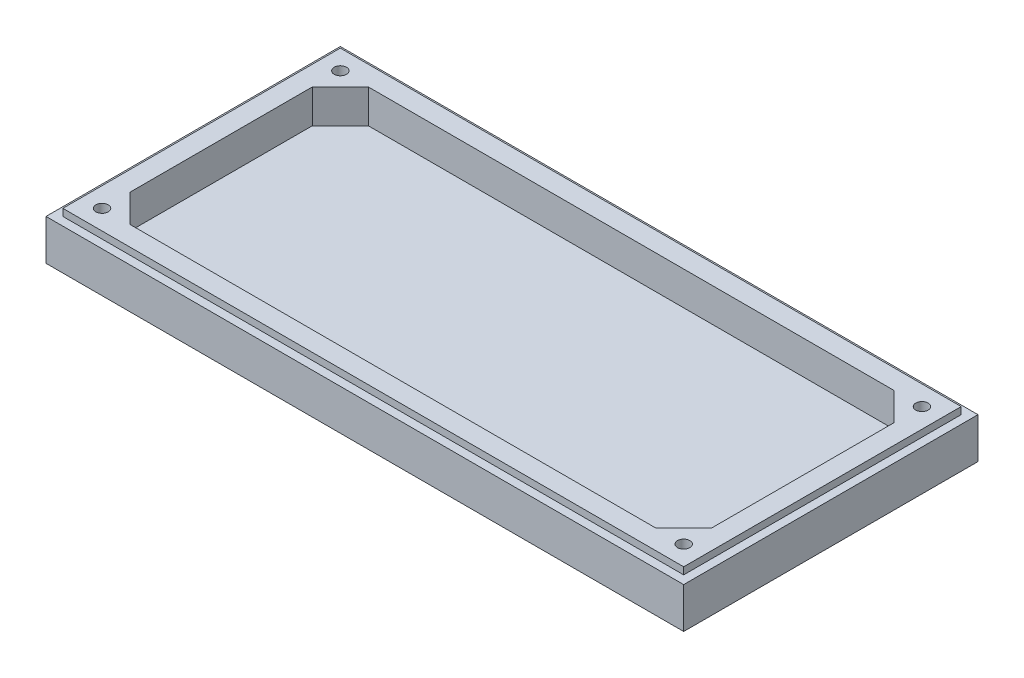
ISO-10303-21;
HEADER;
FILE_DESCRIPTION(('STEP AP214'),'2;1');
FILE_NAME('part.step','',(''),(''),'','','');
FILE_SCHEMA(('AUTOMOTIVE_DESIGN { 1 0 10303 214 1 1 1 1 }'));
ENDSEC;
DATA;
#1=APPLICATION_CONTEXT('core data for automotive mechanical design processes');
#2=APPLICATION_PROTOCOL_DEFINITION('international standard','automotive_design',2000,#1);
#3=PRODUCT_CONTEXT('',#1,'mechanical');
#4=PRODUCT('Part','Part','',(#3));
#5=PRODUCT_RELATED_PRODUCT_CATEGORY('part','',(#4));
#6=PRODUCT_DEFINITION_FORMATION('','',#4);
#7=PRODUCT_DEFINITION_CONTEXT('part definition',#1,'design');
#8=PRODUCT_DEFINITION('design','',#6,#7);
#9=PRODUCT_DEFINITION_SHAPE('','',#8);
#10=(LENGTH_UNIT() NAMED_UNIT(*) SI_UNIT(.MILLI.,.METRE.));
#11=(NAMED_UNIT(*) PLANE_ANGLE_UNIT() SI_UNIT($,.RADIAN.));
#12=(NAMED_UNIT(*) SI_UNIT($,.STERADIAN.) SOLID_ANGLE_UNIT());
#13=UNCERTAINTY_MEASURE_WITH_UNIT(LENGTH_MEASURE(1.E-05),#10,'distance_accuracy_value','');
#14=(GEOMETRIC_REPRESENTATION_CONTEXT(3) GLOBAL_UNCERTAINTY_ASSIGNED_CONTEXT((#13)) GLOBAL_UNIT_ASSIGNED_CONTEXT((#10,
#11,#12)) REPRESENTATION_CONTEXT('',''));
#15=CARTESIAN_POINT('',(0.,0.,0.));
#16=DIRECTION('',(0.,0.,1.));
#17=DIRECTION('',(1.,0.,0.));
#18=AXIS2_PLACEMENT_3D('',#15,#16,#17);
#19=CARTESIAN_POINT('',(0.,0.,0.));
#20=DIRECTION('',(0.,-1.,0.));
#21=DIRECTION('',(0.,0.,-1.));
#22=AXIS2_PLACEMENT_3D('',#19,#20,#21);
#23=PLANE('',#22);
#24=CARTESIAN_POINT('',(20.,0.,-20.));
#25=DIRECTION('',(0.,1.,0.));
#26=DIRECTION('',(0.,0.,-1.));
#27=AXIS2_PLACEMENT_3D('',#24,#25,#26);
#28=CIRCLE('',#27,4.4);
#29=CARTESIAN_POINT('',(20.,0.,-24.4));
#30=VERTEX_POINT('',#29);
#31=EDGE_CURVE('E757',#30,#30,#28,.T.);
#32=ORIENTED_EDGE('',*,*,#31,.F.);
#33=EDGE_LOOP('',(#32));
#34=FACE_BOUND('',#33,.T.);
#35=CARTESIAN_POINT('',(435.,0.,-19.9999999999999));
#36=DIRECTION('',(0.,1.,0.));
#37=DIRECTION('',(0.,0.,1.));
#38=AXIS2_PLACEMENT_3D('',#35,#36,#37);
#39=CIRCLE('',#38,4.40000000000002);
#40=CARTESIAN_POINT('',(435.,0.,-15.5999999999999));
#41=VERTEX_POINT('',#40);
#42=EDGE_CURVE('E773',#41,#41,#39,.T.);
#43=ORIENTED_EDGE('',*,*,#42,.F.);
#44=EDGE_LOOP('',(#43));
#45=FACE_BOUND('',#44,.T.);
#46=CARTESIAN_POINT('',(435.,0.,-190.));
#47=DIRECTION('',(0.,1.,0.));
#48=DIRECTION('',(0.,0.,-1.));
#49=AXIS2_PLACEMENT_3D('',#46,#47,#48);
#50=CIRCLE('',#49,4.40000000000003);
#51=CARTESIAN_POINT('',(435.,0.,-194.4));
#52=VERTEX_POINT('',#51);
#53=EDGE_CURVE('E765',#52,#52,#50,.T.);
#54=ORIENTED_EDGE('',*,*,#53,.F.);
#55=EDGE_LOOP('',(#54));
#56=FACE_BOUND('',#55,.T.);
#57=CARTESIAN_POINT('',(20.,0.,-190.));
#58=DIRECTION('',(0.,1.,0.));
#59=DIRECTION('',(0.,0.,1.));
#60=AXIS2_PLACEMENT_3D('',#57,#58,#59);
#61=CIRCLE('',#60,4.4);
#62=CARTESIAN_POINT('',(20.,0.,-185.6));
#63=VERTEX_POINT('',#62);
#64=EDGE_CURVE('E184',#63,#63,#61,.T.);
#65=ORIENTED_EDGE('',*,*,#64,.F.);
#66=EDGE_LOOP('',(#65));
#67=FACE_BOUND('',#66,.T.);
#68=DIRECTION('',(0.707106781186548,0.,0.707106781186548));
#69=VECTOR('',#68,1.);
#70=CARTESIAN_POINT('',(20.,0.,-40.));
#71=LINE('',#70,#69);
#72=CARTESIAN_POINT('',(20.,0.,-40.));
#73=VERTEX_POINT('',#72);
#74=CARTESIAN_POINT('',(40.,0.,-20.));
#75=VERTEX_POINT('',#74);
#76=EDGE_CURVE('E232',#73,#75,#71,.T.);
#77=ORIENTED_EDGE('',*,*,#76,.F.);
#78=DIRECTION('',(0.,0.,1.));
#79=VECTOR('',#78,1.);
#80=CARTESIAN_POINT('',(20.,0.,-170.));
#81=LINE('',#80,#79);
#82=CARTESIAN_POINT('',(20.,0.,-170.));
#83=VERTEX_POINT('',#82);
#84=EDGE_CURVE('E204',#83,#73,#81,.T.);
#85=ORIENTED_EDGE('',*,*,#84,.F.);
#86=DIRECTION('',(-0.707106781186547,0.,0.707106781186547));
#87=VECTOR('',#86,1.);
#88=CARTESIAN_POINT('',(40.,0.,-190.));
#89=LINE('',#88,#87);
#90=CARTESIAN_POINT('',(40.,0.,-190.));
#91=VERTEX_POINT('',#90);
#92=EDGE_CURVE('E209',#91,#83,#89,.T.);
#93=ORIENTED_EDGE('',*,*,#92,.F.);
#94=DIRECTION('',(-1.,0.,0.));
#95=VECTOR('',#94,1.);
#96=CARTESIAN_POINT('',(40.,0.,-190.));
#97=LINE('',#96,#95);
#98=CARTESIAN_POINT('',(415.,0.,-190.));
#99=VERTEX_POINT('',#98);
#100=EDGE_CURVE('E247',#99,#91,#97,.T.);
#101=ORIENTED_EDGE('',*,*,#100,.F.);
#102=DIRECTION('',(-0.707106781186548,0.,-0.707106781186547));
#103=VECTOR('',#102,1.);
#104=CARTESIAN_POINT('',(415.,0.,-190.));
#105=LINE('',#104,#103);
#106=CARTESIAN_POINT('',(435.,0.,-170.));
#107=VERTEX_POINT('',#106);
#108=EDGE_CURVE('E244',#107,#99,#105,.T.);
#109=ORIENTED_EDGE('',*,*,#108,.F.);
#110=DIRECTION('',(0.,0.,-1.));
#111=VECTOR('',#110,1.);
#112=CARTESIAN_POINT('',(435.,0.,-170.));
#113=LINE('',#112,#111);
#114=CARTESIAN_POINT('',(435.,0.,-40.));
#115=VERTEX_POINT('',#114);
#116=EDGE_CURVE('E241',#115,#107,#113,.T.);
#117=ORIENTED_EDGE('',*,*,#116,.F.);
#118=DIRECTION('',(0.707106781186548,0.,-0.707106781186547));
#119=VECTOR('',#118,1.);
#120=CARTESIAN_POINT('',(415.,0.,-20.));
#121=LINE('',#120,#119);
#122=CARTESIAN_POINT('',(415.,0.,-20.));
#123=VERTEX_POINT('',#122);
#124=EDGE_CURVE('E238',#123,#115,#121,.T.);
#125=ORIENTED_EDGE('',*,*,#124,.F.);
#126=DIRECTION('',(1.,0.,0.));
#127=VECTOR('',#126,1.);
#128=CARTESIAN_POINT('',(40.,0.,-20.));
#129=LINE('',#128,#127);
#130=EDGE_CURVE('E235',#75,#123,#129,.T.);
#131=ORIENTED_EDGE('',*,*,#130,.F.);
#132=EDGE_LOOP('',(#77,#85,#93,#101,#109,#117,#125,#131));
#133=FACE_BOUND('',#132,.T.);
#134=DIRECTION('',(0.,0.,1.));
#135=VECTOR('',#134,1.);
#136=CARTESIAN_POINT('',(6.,0.,-204.));
#137=LINE('',#136,#135);
#138=CARTESIAN_POINT('',(6.,0.,-204.));
#139=VERTEX_POINT('',#138);
#140=CARTESIAN_POINT('',(6.00000000000003,0.,-6.00000000000001));
#141=VERTEX_POINT('',#140);
#142=EDGE_CURVE('E189',#139,#141,#137,.T.);
#143=ORIENTED_EDGE('',*,*,#142,.T.);
#144=DIRECTION('',(1.,0.,0.));
#145=VECTOR('',#144,1.);
#146=CARTESIAN_POINT('',(6.00000000000002,0.,-6.));
#147=LINE('',#146,#145);
#148=CARTESIAN_POINT('',(449.,0.,-6.));
#149=VERTEX_POINT('',#148);
#150=EDGE_CURVE('E160',#141,#149,#147,.T.);
#151=ORIENTED_EDGE('',*,*,#150,.T.);
#152=DIRECTION('',(0.,0.,-1.));
#153=VECTOR('',#152,1.);
#154=CARTESIAN_POINT('',(449.,0.,-204.));
#155=LINE('',#154,#153);
#156=CARTESIAN_POINT('',(449.,0.,-204.));
#157=VERTEX_POINT('',#156);
#158=EDGE_CURVE('E64',#149,#157,#155,.T.);
#159=ORIENTED_EDGE('',*,*,#158,.T.);
#160=DIRECTION('',(-1.,0.,0.));
#161=VECTOR('',#160,1.);
#162=CARTESIAN_POINT('',(6.,0.,-204.));
#163=LINE('',#162,#161);
#164=EDGE_CURVE('E179',#157,#139,#163,.T.);
#165=ORIENTED_EDGE('',*,*,#164,.T.);
#166=EDGE_LOOP('',(#143,#151,#159,#165));
#167=FACE_BOUND('',#166,.T.);
#168=ADVANCED_FACE('F42',(#34,#45,#56,#67,#133,#167),#23,.F.);
#169=CARTESIAN_POINT('',(20.,-24.,-170.));
#170=DIRECTION('',(-1.,0.,0.));
#171=DIRECTION('',(0.,0.,1.));
#172=AXIS2_PLACEMENT_3D('',#169,#170,#171);
#173=PLANE('',#172);
#174=ORIENTED_EDGE('',*,*,#84,.T.);
#175=DIRECTION('',(0.,1.,0.));
#176=VECTOR('',#175,1.);
#177=CARTESIAN_POINT('',(20.,-24.,-40.));
#178=LINE('',#177,#176);
#179=CARTESIAN_POINT('',(20.,-24.,-40.));
#180=VERTEX_POINT('',#179);
#181=EDGE_CURVE('E230',#180,#73,#178,.T.);
#182=ORIENTED_EDGE('',*,*,#181,.F.);
#183=DIRECTION('',(0.,0.,1.));
#184=VECTOR('',#183,1.);
#185=CARTESIAN_POINT('',(20.,-24.,-170.));
#186=LINE('',#185,#184);
#187=CARTESIAN_POINT('',(20.,-24.,-170.));
#188=VERTEX_POINT('',#187);
#189=EDGE_CURVE('E205',#188,#180,#186,.T.);
#190=ORIENTED_EDGE('',*,*,#189,.F.);
#191=DIRECTION('',(0.,1.,0.));
#192=VECTOR('',#191,1.);
#193=CARTESIAN_POINT('',(20.,-24.,-170.));
#194=LINE('',#193,#192);
#195=EDGE_CURVE('E252',#188,#83,#194,.T.);
#196=ORIENTED_EDGE('',*,*,#195,.T.);
#197=EDGE_LOOP('',(#174,#182,#190,#196));
#198=FACE_BOUND('',#197,.T.);
#199=ADVANCED_FACE('F315',(#198),#173,.F.);
#200=CARTESIAN_POINT('',(40.,-24.,-190.));
#201=DIRECTION('',(-0.707106781186548,0.,-0.707106781186548));
#202=DIRECTION('',(-0.707106781186548,0.,0.707106781186548));
#203=AXIS2_PLACEMENT_3D('',#200,#201,#202);
#204=PLANE('',#203);
#205=ORIENTED_EDGE('',*,*,#92,.T.);
#206=ORIENTED_EDGE('',*,*,#195,.F.);
#207=DIRECTION('',(-0.707106781186547,0.,0.707106781186547));
#208=VECTOR('',#207,1.);
#209=CARTESIAN_POINT('',(40.,-24.,-190.));
#210=LINE('',#209,#208);
#211=CARTESIAN_POINT('',(40.,-24.,-190.));
#212=VERTEX_POINT('',#211);
#213=EDGE_CURVE('E227',#212,#188,#210,.T.);
#214=ORIENTED_EDGE('',*,*,#213,.F.);
#215=DIRECTION('',(0.,1.,0.));
#216=VECTOR('',#215,1.);
#217=CARTESIAN_POINT('',(40.,-24.,-190.));
#218=LINE('',#217,#216);
#219=EDGE_CURVE('E255',#212,#91,#218,.T.);
#220=ORIENTED_EDGE('',*,*,#219,.T.);
#221=EDGE_LOOP('',(#205,#206,#214,#220));
#222=FACE_BOUND('',#221,.T.);
#223=ADVANCED_FACE('F320',(#222),#204,.F.);
#224=CARTESIAN_POINT('',(40.,-24.,-190.));
#225=DIRECTION('',(0.,0.,-1.));
#226=DIRECTION('',(-1.,0.,0.));
#227=AXIS2_PLACEMENT_3D('',#224,#225,#226);
#228=PLANE('',#227);
#229=ORIENTED_EDGE('',*,*,#100,.T.);
#230=ORIENTED_EDGE('',*,*,#219,.F.);
#231=DIRECTION('',(-1.,0.,0.));
#232=VECTOR('',#231,1.);
#233=CARTESIAN_POINT('',(40.,-24.,-190.));
#234=LINE('',#233,#232);
#235=CARTESIAN_POINT('',(415.,-24.,-190.));
#236=VERTEX_POINT('',#235);
#237=EDGE_CURVE('E224',#236,#212,#234,.T.);
#238=ORIENTED_EDGE('',*,*,#237,.F.);
#239=DIRECTION('',(0.,1.,0.));
#240=VECTOR('',#239,1.);
#241=CARTESIAN_POINT('',(415.,-24.,-190.));
#242=LINE('',#241,#240);
#243=EDGE_CURVE('E257',#236,#99,#242,.T.);
#244=ORIENTED_EDGE('',*,*,#243,.T.);
#245=EDGE_LOOP('',(#229,#230,#238,#244));
#246=FACE_BOUND('',#245,.T.);
#247=ADVANCED_FACE('F364',(#246),#228,.F.);
#248=CARTESIAN_POINT('',(415.,-24.,-190.));
#249=DIRECTION('',(0.707106781186547,0.,-0.707106781186548));
#250=DIRECTION('',(-0.707106781186548,0.,-0.707106781186547));
#251=AXIS2_PLACEMENT_3D('',#248,#249,#250);
#252=PLANE('',#251);
#253=ORIENTED_EDGE('',*,*,#108,.T.);
#254=ORIENTED_EDGE('',*,*,#243,.F.);
#255=DIRECTION('',(-0.707106781186548,0.,-0.707106781186547));
#256=VECTOR('',#255,1.);
#257=CARTESIAN_POINT('',(415.,-24.,-190.));
#258=LINE('',#257,#256);
#259=CARTESIAN_POINT('',(435.,-24.,-170.));
#260=VERTEX_POINT('',#259);
#261=EDGE_CURVE('E221',#260,#236,#258,.T.);
#262=ORIENTED_EDGE('',*,*,#261,.F.);
#263=DIRECTION('',(0.,1.,0.));
#264=VECTOR('',#263,1.);
#265=CARTESIAN_POINT('',(435.,-24.,-170.));
#266=LINE('',#265,#264);
#267=EDGE_CURVE('E259',#260,#107,#266,.T.);
#268=ORIENTED_EDGE('',*,*,#267,.T.);
#269=EDGE_LOOP('',(#253,#254,#262,#268));
#270=FACE_BOUND('',#269,.T.);
#271=ADVANCED_FACE('F368',(#270),#252,.F.);
#272=CARTESIAN_POINT('',(435.,-24.,-170.));
#273=DIRECTION('',(1.,0.,0.));
#274=DIRECTION('',(0.,0.,-1.));
#275=AXIS2_PLACEMENT_3D('',#272,#273,#274);
#276=PLANE('',#275);
#277=ORIENTED_EDGE('',*,*,#116,.T.);
#278=ORIENTED_EDGE('',*,*,#267,.F.);
#279=DIRECTION('',(0.,0.,-1.));
#280=VECTOR('',#279,1.);
#281=CARTESIAN_POINT('',(435.,-24.,-170.));
#282=LINE('',#281,#280);
#283=CARTESIAN_POINT('',(435.,-24.,-40.));
#284=VERTEX_POINT('',#283);
#285=EDGE_CURVE('E218',#284,#260,#282,.T.);
#286=ORIENTED_EDGE('',*,*,#285,.F.);
#287=DIRECTION('',(0.,1.,0.));
#288=VECTOR('',#287,1.);
#289=CARTESIAN_POINT('',(435.,-24.,-40.));
#290=LINE('',#289,#288);
#291=EDGE_CURVE('E261',#284,#115,#290,.T.);
#292=ORIENTED_EDGE('',*,*,#291,.T.);
#293=EDGE_LOOP('',(#277,#278,#286,#292));
#294=FACE_BOUND('',#293,.T.);
#295=ADVANCED_FACE('F372',(#294),#276,.F.);
#296=CARTESIAN_POINT('',(415.,-24.,-20.));
#297=DIRECTION('',(0.707106781186547,0.,0.707106781186548));
#298=DIRECTION('',(0.707106781186548,0.,-0.707106781186547));
#299=AXIS2_PLACEMENT_3D('',#296,#297,#298);
#300=PLANE('',#299);
#301=ORIENTED_EDGE('',*,*,#124,.T.);
#302=ORIENTED_EDGE('',*,*,#291,.F.);
#303=DIRECTION('',(0.707106781186548,0.,-0.707106781186547));
#304=VECTOR('',#303,1.);
#305=CARTESIAN_POINT('',(415.,-24.,-20.));
#306=LINE('',#305,#304);
#307=CARTESIAN_POINT('',(415.,-24.,-20.));
#308=VERTEX_POINT('',#307);
#309=EDGE_CURVE('E215',#308,#284,#306,.T.);
#310=ORIENTED_EDGE('',*,*,#309,.F.);
#311=DIRECTION('',(0.,1.,0.));
#312=VECTOR('',#311,1.);
#313=CARTESIAN_POINT('',(415.,-24.,-20.));
#314=LINE('',#313,#312);
#315=EDGE_CURVE('E263',#308,#123,#314,.T.);
#316=ORIENTED_EDGE('',*,*,#315,.T.);
#317=EDGE_LOOP('',(#301,#302,#310,#316));
#318=FACE_BOUND('',#317,.T.);
#319=ADVANCED_FACE('F376',(#318),#300,.F.);
#320=CARTESIAN_POINT('',(40.,-24.,-20.));
#321=DIRECTION('',(0.,0.,1.));
#322=DIRECTION('',(1.,0.,0.));
#323=AXIS2_PLACEMENT_3D('',#320,#321,#322);
#324=PLANE('',#323);
#325=ORIENTED_EDGE('',*,*,#130,.T.);
#326=ORIENTED_EDGE('',*,*,#315,.F.);
#327=DIRECTION('',(1.,0.,0.));
#328=VECTOR('',#327,1.);
#329=CARTESIAN_POINT('',(40.,-24.,-20.));
#330=LINE('',#329,#328);
#331=CARTESIAN_POINT('',(40.,-24.,-20.));
#332=VERTEX_POINT('',#331);
#333=EDGE_CURVE('E212',#332,#308,#330,.T.);
#334=ORIENTED_EDGE('',*,*,#333,.F.);
#335=DIRECTION('',(0.,1.,0.));
#336=VECTOR('',#335,1.);
#337=CARTESIAN_POINT('',(40.,-24.,-20.));
#338=LINE('',#337,#336);
#339=EDGE_CURVE('E265',#332,#75,#338,.T.);
#340=ORIENTED_EDGE('',*,*,#339,.T.);
#341=EDGE_LOOP('',(#325,#326,#334,#340));
#342=FACE_BOUND('',#341,.T.);
#343=ADVANCED_FACE('F380',(#342),#324,.F.);
#344=CARTESIAN_POINT('',(20.,-24.,-40.));
#345=DIRECTION('',(-0.707106781186547,0.,0.707106781186547));
#346=DIRECTION('',(0.707106781186548,0.,0.707106781186548));
#347=AXIS2_PLACEMENT_3D('',#344,#345,#346);
#348=PLANE('',#347);
#349=ORIENTED_EDGE('',*,*,#76,.T.);
#350=ORIENTED_EDGE('',*,*,#339,.F.);
#351=DIRECTION('',(0.707106781186548,0.,0.707106781186548));
#352=VECTOR('',#351,1.);
#353=CARTESIAN_POINT('',(20.,-24.,-40.));
#354=LINE('',#353,#352);
#355=EDGE_CURVE('E208',#180,#332,#354,.T.);
#356=ORIENTED_EDGE('',*,*,#355,.F.);
#357=ORIENTED_EDGE('',*,*,#181,.T.);
#358=EDGE_LOOP('',(#349,#350,#356,#357));
#359=FACE_BOUND('',#358,.T.);
#360=ADVANCED_FACE('F360',(#359),#348,.F.);
#361=CARTESIAN_POINT('',(0.,-24.,0.));
#362=DIRECTION('',(0.,1.,0.));
#363=DIRECTION('',(0.,0.,1.));
#364=AXIS2_PLACEMENT_3D('',#361,#362,#363);
#365=PLANE('',#364);
#366=ORIENTED_EDGE('',*,*,#189,.T.);
#367=ORIENTED_EDGE('',*,*,#355,.T.);
#368=ORIENTED_EDGE('',*,*,#333,.T.);
#369=ORIENTED_EDGE('',*,*,#309,.T.);
#370=ORIENTED_EDGE('',*,*,#285,.T.);
#371=ORIENTED_EDGE('',*,*,#261,.T.);
#372=ORIENTED_EDGE('',*,*,#237,.T.);
#373=ORIENTED_EDGE('',*,*,#213,.T.);
#374=EDGE_LOOP('',(#366,#367,#368,#369,#370,#371,#372,#373));
#375=FACE_BOUND('',#374,.T.);
#376=ADVANCED_FACE('F357',(#375),#365,.T.);
#377=CARTESIAN_POINT('',(227.5,-5.,-105.));
#378=DIRECTION('',(0.,1.,0.));
#379=DIRECTION('',(0.,0.,1.));
#380=AXIS2_PLACEMENT_3D('',#377,#378,#379);
#381=PLANE('',#380);
#382=DIRECTION('',(-1.,0.,0.));
#383=VECTOR('',#382,1.);
#384=CARTESIAN_POINT('',(6.,-5.,-204.));
#385=LINE('',#384,#383);
#386=CARTESIAN_POINT('',(449.,-5.,-204.));
#387=VERTEX_POINT('',#386);
#388=CARTESIAN_POINT('',(6.,-5.,-204.));
#389=VERTEX_POINT('',#388);
#390=EDGE_CURVE('E166',#387,#389,#385,.T.);
#391=ORIENTED_EDGE('',*,*,#390,.F.);
#392=DIRECTION('',(0.,0.,-1.));
#393=VECTOR('',#392,1.);
#394=CARTESIAN_POINT('',(449.,-5.,-204.));
#395=LINE('',#394,#393);
#396=CARTESIAN_POINT('',(449.,-5.,-6.00000000000001));
#397=VERTEX_POINT('',#396);
#398=EDGE_CURVE('E175',#397,#387,#395,.T.);
#399=ORIENTED_EDGE('',*,*,#398,.F.);
#400=DIRECTION('',(1.,0.,0.));
#401=VECTOR('',#400,1.);
#402=CARTESIAN_POINT('',(6.00000000000002,-5.,-6.));
#403=LINE('',#402,#401);
#404=CARTESIAN_POINT('',(6.00000000000002,-5.,-6.));
#405=VERTEX_POINT('',#404);
#406=EDGE_CURVE('E158',#405,#397,#403,.T.);
#407=ORIENTED_EDGE('',*,*,#406,.F.);
#408=DIRECTION('',(0.,0.,1.));
#409=VECTOR('',#408,1.);
#410=CARTESIAN_POINT('',(6.,-5.,-204.));
#411=LINE('',#410,#409);
#412=EDGE_CURVE('E172',#389,#405,#411,.T.);
#413=ORIENTED_EDGE('',*,*,#412,.F.);
#414=EDGE_LOOP('',(#391,#399,#407,#413));
#415=FACE_BOUND('',#414,.T.);
#416=DIRECTION('',(-1.,0.,0.));
#417=VECTOR('',#416,1.);
#418=CARTESIAN_POINT('',(0.,-5.,-210.));
#419=LINE('',#418,#417);
#420=CARTESIAN_POINT('',(455.,-5.,-210.));
#421=VERTEX_POINT('',#420);
#422=CARTESIAN_POINT('',(0.,-5.,-210.));
#423=VERTEX_POINT('',#422);
#424=EDGE_CURVE('E57',#421,#423,#419,.T.);
#425=ORIENTED_EDGE('',*,*,#424,.T.);
#426=DIRECTION('',(0.,0.,-1.));
#427=VECTOR('',#426,1.);
#428=CARTESIAN_POINT('',(0.,-5.,-210.));
#429=LINE('',#428,#427);
#430=CARTESIAN_POINT('',(0.,-5.,0.));
#431=VERTEX_POINT('',#430);
#432=EDGE_CURVE('E12',#431,#423,#429,.T.);
#433=ORIENTED_EDGE('',*,*,#432,.F.);
#434=DIRECTION('',(-1.,0.,0.));
#435=VECTOR('',#434,1.);
#436=CARTESIAN_POINT('',(0.,-5.,0.));
#437=LINE('',#436,#435);
#438=CARTESIAN_POINT('',(455.,-5.,0.));
#439=VERTEX_POINT('',#438);
#440=EDGE_CURVE('E195',#439,#431,#437,.T.);
#441=ORIENTED_EDGE('',*,*,#440,.F.);
#442=DIRECTION('',(0.,0.,-1.));
#443=VECTOR('',#442,1.);
#444=CARTESIAN_POINT('',(455.,-5.,-210.));
#445=LINE('',#444,#443);
#446=EDGE_CURVE('E201',#439,#421,#445,.T.);
#447=ORIENTED_EDGE('',*,*,#446,.T.);
#448=EDGE_LOOP('',(#425,#433,#441,#447));
#449=FACE_BOUND('',#448,.T.);
#450=ADVANCED_FACE('F171',(#415,#449),#381,.T.);
#451=CARTESIAN_POINT('',(6.,-5.,-204.));
#452=DIRECTION('',(-1.,0.,0.));
#453=DIRECTION('',(0.,0.,1.));
#454=AXIS2_PLACEMENT_3D('',#451,#452,#453);
#455=PLANE('',#454);
#456=ORIENTED_EDGE('',*,*,#142,.F.);
#457=DIRECTION('',(0.,1.,0.));
#458=VECTOR('',#457,1.);
#459=CARTESIAN_POINT('',(6.,-5.,-204.));
#460=LINE('',#459,#458);
#461=EDGE_CURVE('E178',#389,#139,#460,.T.);
#462=ORIENTED_EDGE('',*,*,#461,.F.);
#463=ORIENTED_EDGE('',*,*,#412,.T.);
#464=DIRECTION('',(0.,1.,0.));
#465=VECTOR('',#464,1.);
#466=CARTESIAN_POINT('',(6.00000000000002,-5.,-6.));
#467=LINE('',#466,#465);
#468=EDGE_CURVE('E155',#405,#141,#467,.T.);
#469=ORIENTED_EDGE('',*,*,#468,.T.);
#470=EDGE_LOOP('',(#456,#462,#463,#469));
#471=FACE_BOUND('',#470,.T.);
#472=ADVANCED_FACE('F177',(#471),#455,.T.);
#473=CARTESIAN_POINT('',(6.,-5.,-204.));
#474=DIRECTION('',(0.,0.,-1.));
#475=DIRECTION('',(-1.,0.,0.));
#476=AXIS2_PLACEMENT_3D('',#473,#474,#475);
#477=PLANE('',#476);
#478=ORIENTED_EDGE('',*,*,#164,.F.);
#479=DIRECTION('',(0.,1.,0.));
#480=VECTOR('',#479,1.);
#481=CARTESIAN_POINT('',(449.,-5.,-204.));
#482=LINE('',#481,#480);
#483=EDGE_CURVE('E196',#387,#157,#482,.T.);
#484=ORIENTED_EDGE('',*,*,#483,.F.);
#485=ORIENTED_EDGE('',*,*,#390,.T.);
#486=ORIENTED_EDGE('',*,*,#461,.T.);
#487=EDGE_LOOP('',(#478,#484,#485,#486));
#488=FACE_BOUND('',#487,.T.);
#489=ADVANCED_FACE('F347',(#488),#477,.T.);
#490=CARTESIAN_POINT('',(449.,-5.,-204.));
#491=DIRECTION('',(1.,0.,0.));
#492=DIRECTION('',(0.,0.,-1.));
#493=AXIS2_PLACEMENT_3D('',#490,#491,#492);
#494=PLANE('',#493);
#495=ORIENTED_EDGE('',*,*,#158,.F.);
#496=DIRECTION('',(0.,1.,0.));
#497=VECTOR('',#496,1.);
#498=CARTESIAN_POINT('',(449.,-5.,-6.));
#499=LINE('',#498,#497);
#500=EDGE_CURVE('E165',#397,#149,#499,.T.);
#501=ORIENTED_EDGE('',*,*,#500,.F.);
#502=ORIENTED_EDGE('',*,*,#398,.T.);
#503=ORIENTED_EDGE('',*,*,#483,.T.);
#504=EDGE_LOOP('',(#495,#501,#502,#503));
#505=FACE_BOUND('',#504,.T.);
#506=ADVANCED_FACE('F310',(#505),#494,.T.);
#507=CARTESIAN_POINT('',(6.00000000000002,-5.,-6.));
#508=DIRECTION('',(0.,0.,1.));
#509=DIRECTION('',(1.,0.,0.));
#510=AXIS2_PLACEMENT_3D('',#507,#508,#509);
#511=PLANE('',#510);
#512=ORIENTED_EDGE('',*,*,#150,.F.);
#513=ORIENTED_EDGE('',*,*,#468,.F.);
#514=ORIENTED_EDGE('',*,*,#406,.T.);
#515=ORIENTED_EDGE('',*,*,#500,.T.);
#516=EDGE_LOOP('',(#512,#513,#514,#515));
#517=FACE_BOUND('',#516,.T.);
#518=ADVANCED_FACE('F157',(#517),#511,.T.);
#519=CARTESIAN_POINT('',(0.,-34.,0.));
#520=DIRECTION('',(0.,-1.,0.));
#521=DIRECTION('',(0.,0.,-1.));
#522=AXIS2_PLACEMENT_3D('',#519,#520,#521);
#523=PLANE('',#522);
#524=DIRECTION('',(1.,0.,0.));
#525=VECTOR('',#524,1.);
#526=CARTESIAN_POINT('',(0.,-34.,-210.));
#527=LINE('',#526,#525);
#528=CARTESIAN_POINT('',(0.,-34.,-210.));
#529=VERTEX_POINT('',#528);
#530=CARTESIAN_POINT('',(455.,-34.,-210.));
#531=VERTEX_POINT('',#530);
#532=EDGE_CURVE('E254',#529,#531,#527,.T.);
#533=ORIENTED_EDGE('',*,*,#532,.T.);
#534=DIRECTION('',(0.,0.,1.));
#535=VECTOR('',#534,1.);
#536=CARTESIAN_POINT('',(455.,-34.,-210.));
#537=LINE('',#536,#535);
#538=CARTESIAN_POINT('',(455.,-34.,0.));
#539=VERTEX_POINT('',#538);
#540=EDGE_CURVE('E271',#531,#539,#537,.T.);
#541=ORIENTED_EDGE('',*,*,#540,.T.);
#542=DIRECTION('',(1.,0.,0.));
#543=VECTOR('',#542,1.);
#544=CARTESIAN_POINT('',(0.,-34.,0.));
#545=LINE('',#544,#543);
#546=CARTESIAN_POINT('',(0.,-34.,0.));
#547=VERTEX_POINT('',#546);
#548=EDGE_CURVE('E273',#547,#539,#545,.T.);
#549=ORIENTED_EDGE('',*,*,#548,.F.);
#550=DIRECTION('',(0.,0.,1.));
#551=VECTOR('',#550,1.);
#552=CARTESIAN_POINT('',(0.,-34.,-210.));
#553=LINE('',#552,#551);
#554=EDGE_CURVE('E276',#529,#547,#553,.T.);
#555=ORIENTED_EDGE('',*,*,#554,.F.);
#556=EDGE_LOOP('',(#533,#541,#549,#555));
#557=FACE_BOUND('',#556,.T.);
#558=ADVANCED_FACE('F302',(#557),#523,.T.);
#559=CARTESIAN_POINT('',(0.,-34.,-210.));
#560=DIRECTION('',(-1.,0.,0.));
#561=DIRECTION('',(0.,0.,1.));
#562=AXIS2_PLACEMENT_3D('',#559,#560,#561);
#563=PLANE('',#562);
#564=DIRECTION('',(0.,1.,0.));
#565=VECTOR('',#564,1.);
#566=CARTESIAN_POINT('',(0.,-34.,0.));
#567=LINE('',#566,#565);
#568=EDGE_CURVE('E282',#547,#431,#567,.T.);
#569=ORIENTED_EDGE('',*,*,#568,.T.);
#570=ORIENTED_EDGE('',*,*,#432,.T.);
#571=DIRECTION('',(0.,1.,0.));
#572=VECTOR('',#571,1.);
#573=CARTESIAN_POINT('',(0.,-34.,-210.));
#574=LINE('',#573,#572);
#575=EDGE_CURVE('E279',#529,#423,#574,.T.);
#576=ORIENTED_EDGE('',*,*,#575,.F.);
#577=ORIENTED_EDGE('',*,*,#554,.T.);
#578=EDGE_LOOP('',(#569,#570,#576,#577));
#579=FACE_BOUND('',#578,.T.);
#580=ADVANCED_FACE('F297',(#579),#563,.T.);
#581=CARTESIAN_POINT('',(0.,-34.,0.));
#582=DIRECTION('',(0.,0.,1.));
#583=DIRECTION('',(1.,0.,0.));
#584=AXIS2_PLACEMENT_3D('',#581,#582,#583);
#585=PLANE('',#584);
#586=DIRECTION('',(0.,1.,0.));
#587=VECTOR('',#586,1.);
#588=CARTESIAN_POINT('',(455.,-34.,0.));
#589=LINE('',#588,#587);
#590=EDGE_CURVE('E285',#539,#439,#589,.T.);
#591=ORIENTED_EDGE('',*,*,#590,.T.);
#592=ORIENTED_EDGE('',*,*,#440,.T.);
#593=ORIENTED_EDGE('',*,*,#568,.F.);
#594=ORIENTED_EDGE('',*,*,#548,.T.);
#595=EDGE_LOOP('',(#591,#592,#593,#594));
#596=FACE_BOUND('',#595,.T.);
#597=ADVANCED_FACE('F299',(#596),#585,.T.);
#598=CARTESIAN_POINT('',(455.,-34.,-210.));
#599=DIRECTION('',(-1.,0.,0.));
#600=DIRECTION('',(0.,0.,1.));
#601=AXIS2_PLACEMENT_3D('',#598,#599,#600);
#602=PLANE('',#601);
#603=ORIENTED_EDGE('',*,*,#446,.F.);
#604=ORIENTED_EDGE('',*,*,#590,.F.);
#605=ORIENTED_EDGE('',*,*,#540,.F.);
#606=DIRECTION('',(0.,1.,0.));
#607=VECTOR('',#606,1.);
#608=CARTESIAN_POINT('',(455.,-34.,-210.));
#609=LINE('',#608,#607);
#610=EDGE_CURVE('E50',#531,#421,#609,.T.);
#611=ORIENTED_EDGE('',*,*,#610,.T.);
#612=EDGE_LOOP('',(#603,#604,#605,#611));
#613=FACE_BOUND('',#612,.T.);
#614=ADVANCED_FACE('F291',(#613),#602,.F.);
#615=CARTESIAN_POINT('',(0.,-34.,-210.));
#616=DIRECTION('',(0.,0.,1.));
#617=DIRECTION('',(1.,0.,0.));
#618=AXIS2_PLACEMENT_3D('',#615,#616,#617);
#619=PLANE('',#618);
#620=ORIENTED_EDGE('',*,*,#424,.F.);
#621=ORIENTED_EDGE('',*,*,#610,.F.);
#622=ORIENTED_EDGE('',*,*,#532,.F.);
#623=ORIENTED_EDGE('',*,*,#575,.T.);
#624=EDGE_LOOP('',(#620,#621,#622,#623));
#625=FACE_BOUND('',#624,.T.);
#626=ADVANCED_FACE('F44',(#625),#619,.F.);
#627=CARTESIAN_POINT('',(20.,-20.,-190.));
#628=DIRECTION('',(0.,1.,0.));
#629=DIRECTION('',(0.,0.,1.));
#630=AXIS2_PLACEMENT_3D('',#627,#628,#629);
#631=CYLINDRICAL_SURFACE('',#630,4.4);
#632=CARTESIAN_POINT('',(20.,-20.,-190.));
#633=DIRECTION('',(0.,1.,0.));
#634=DIRECTION('',(0.,0.,1.));
#635=AXIS2_PLACEMENT_3D('',#632,#633,#634);
#636=CIRCLE('',#635,4.4);
#637=CARTESIAN_POINT('',(20.,-20.,-185.6));
#638=VERTEX_POINT('',#637);
#639=EDGE_CURVE('E191',#638,#638,#636,.T.);
#640=ORIENTED_EDGE('',*,*,#639,.F.);
#641=EDGE_LOOP('',(#640));
#642=FACE_BOUND('',#641,.T.);
#643=ORIENTED_EDGE('',*,*,#64,.T.);
#644=EDGE_LOOP('',(#643));
#645=FACE_BOUND('',#644,.T.);
#646=ADVANCED_FACE('F330',(#642,#645),#631,.F.);
#647=CARTESIAN_POINT('',(20.,-20.,-190.));
#648=DIRECTION('',(0.,1.,0.));
#649=DIRECTION('',(0.,0.,1.));
#650=AXIS2_PLACEMENT_3D('',#647,#648,#649);
#651=PLANE('',#650);
#652=ORIENTED_EDGE('',*,*,#639,.T.);
#653=EDGE_LOOP('',(#652));
#654=FACE_BOUND('',#653,.T.);
#655=ADVANCED_FACE('F334',(#654),#651,.T.);
#656=CARTESIAN_POINT('',(435.,-20.,-190.));
#657=DIRECTION('',(0.,1.,0.));
#658=DIRECTION('',(0.,0.,1.));
#659=AXIS2_PLACEMENT_3D('',#656,#657,#658);
#660=CYLINDRICAL_SURFACE('',#659,4.40000000000003);
#661=CARTESIAN_POINT('',(435.,-20.,-190.));
#662=DIRECTION('',(0.,1.,0.));
#663=DIRECTION('',(0.,0.,-1.));
#664=AXIS2_PLACEMENT_3D('',#661,#662,#663);
#665=CIRCLE('',#664,4.40000000000003);
#666=CARTESIAN_POINT('',(435.,-20.,-194.4));
#667=VERTEX_POINT('',#666);
#668=EDGE_CURVE('E768',#667,#667,#665,.T.);
#669=ORIENTED_EDGE('',*,*,#668,.F.);
#670=EDGE_LOOP('',(#669));
#671=FACE_BOUND('',#670,.T.);
#672=ORIENTED_EDGE('',*,*,#53,.T.);
#673=EDGE_LOOP('',(#672));
#674=FACE_BOUND('',#673,.T.);
#675=ADVANCED_FACE('F340',(#671,#674),#660,.F.);
#676=CARTESIAN_POINT('',(435.,-20.,-190.));
#677=DIRECTION('',(0.,-1.,0.));
#678=DIRECTION('',(0.,0.,-1.));
#679=AXIS2_PLACEMENT_3D('',#676,#677,#678);
#680=PLANE('',#679);
#681=ORIENTED_EDGE('',*,*,#668,.T.);
#682=EDGE_LOOP('',(#681));
#683=FACE_BOUND('',#682,.T.);
#684=ADVANCED_FACE('F481',(#683),#680,.F.);
#685=CARTESIAN_POINT('',(435.,-20.,-19.9999999999999));
#686=DIRECTION('',(0.,1.,0.));
#687=DIRECTION('',(0.,0.,1.));
#688=AXIS2_PLACEMENT_3D('',#685,#686,#687);
#689=CYLINDRICAL_SURFACE('',#688,4.40000000000002);
#690=CARTESIAN_POINT('',(435.,-20.,-19.9999999999999));
#691=DIRECTION('',(0.,1.,0.));
#692=DIRECTION('',(0.,0.,1.));
#693=AXIS2_PLACEMENT_3D('',#690,#691,#692);
#694=CIRCLE('',#693,4.40000000000002);
#695=CARTESIAN_POINT('',(435.,-20.,-15.5999999999999));
#696=VERTEX_POINT('',#695);
#697=EDGE_CURVE('E760',#696,#696,#694,.T.);
#698=ORIENTED_EDGE('',*,*,#697,.F.);
#699=EDGE_LOOP('',(#698));
#700=FACE_BOUND('',#699,.T.);
#701=ORIENTED_EDGE('',*,*,#42,.T.);
#702=EDGE_LOOP('',(#701));
#703=FACE_BOUND('',#702,.T.);
#704=ADVANCED_FACE('F492',(#700,#703),#689,.F.);
#705=CARTESIAN_POINT('',(435.,-20.,-19.9999999999999));
#706=DIRECTION('',(0.,1.,0.));
#707=DIRECTION('',(0.,0.,1.));
#708=AXIS2_PLACEMENT_3D('',#705,#706,#707);
#709=PLANE('',#708);
#710=ORIENTED_EDGE('',*,*,#697,.T.);
#711=EDGE_LOOP('',(#710));
#712=FACE_BOUND('',#711,.T.);
#713=ADVANCED_FACE('F503',(#712),#709,.T.);
#714=CARTESIAN_POINT('',(20.,-20.,-20.));
#715=DIRECTION('',(0.,1.,0.));
#716=DIRECTION('',(0.,0.,1.));
#717=AXIS2_PLACEMENT_3D('',#714,#715,#716);
#718=CYLINDRICAL_SURFACE('',#717,4.4);
#719=CARTESIAN_POINT('',(20.,-20.,-20.));
#720=DIRECTION('',(0.,1.,0.));
#721=DIRECTION('',(0.,0.,-1.));
#722=AXIS2_PLACEMENT_3D('',#719,#720,#721);
#723=CIRCLE('',#722,4.4);
#724=CARTESIAN_POINT('',(20.,-20.,-24.4));
#725=VERTEX_POINT('',#724);
#726=EDGE_CURVE('E756',#725,#725,#723,.T.);
#727=ORIENTED_EDGE('',*,*,#726,.F.);
#728=EDGE_LOOP('',(#727));
#729=FACE_BOUND('',#728,.T.);
#730=ORIENTED_EDGE('',*,*,#31,.T.);
#731=EDGE_LOOP('',(#730));
#732=FACE_BOUND('',#731,.T.);
#733=ADVANCED_FACE('F512',(#729,#732),#718,.F.);
#734=CARTESIAN_POINT('',(20.,-20.,-20.));
#735=DIRECTION('',(0.,-1.,0.));
#736=DIRECTION('',(0.,0.,-1.));
#737=AXIS2_PLACEMENT_3D('',#734,#735,#736);
#738=PLANE('',#737);
#739=ORIENTED_EDGE('',*,*,#726,.T.);
#740=EDGE_LOOP('',(#739));
#741=FACE_BOUND('',#740,.T.);
#742=ADVANCED_FACE('F521',(#741),#738,.F.);
#743=CLOSED_SHELL('',(#168,#199,#223,#247,#271,#295,#319,#343,#360,#376,#450,#472,#489,#506,
#518,#558,#580,#597,#614,#626,#646,#655,#675,#684,#704,#713,#733,#742));
#744=MANIFOLD_SOLID_BREP('B2',#743);
#745=ADVANCED_BREP_SHAPE_REPRESENTATION('',(#18,#744),#14);
#746=SHAPE_DEFINITION_REPRESENTATION(#9,#745);
ENDSEC;
END-ISO-10303-21;
